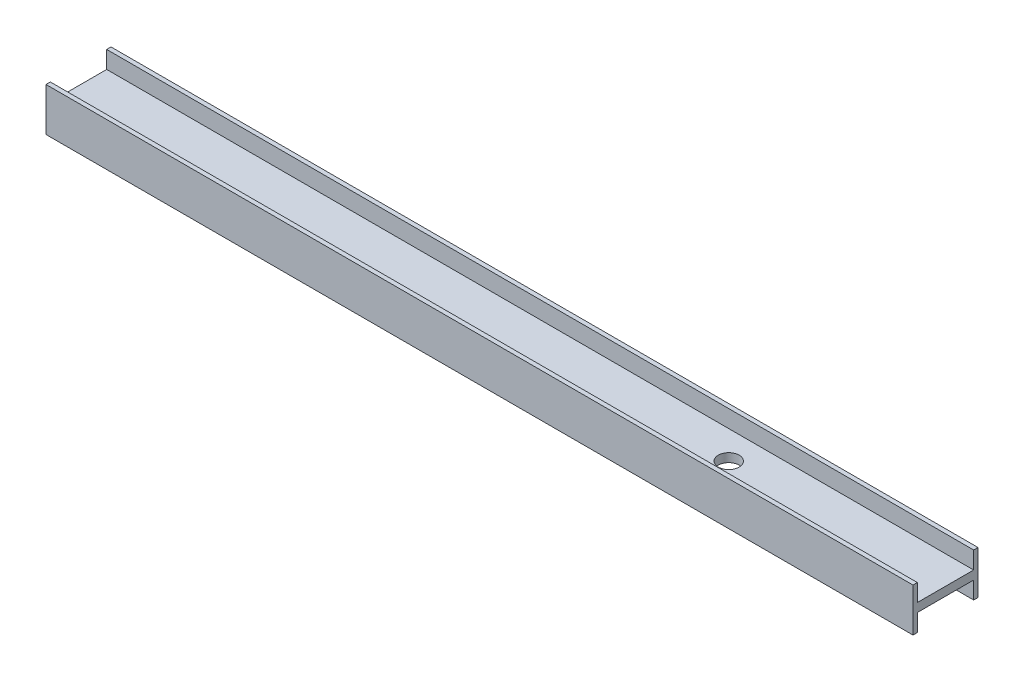
ISO-10303-21;
HEADER;
FILE_DESCRIPTION(('STEP AP214'),'2;1');
FILE_NAME('part.step','',(''),(''),'','','');
FILE_SCHEMA(('AUTOMOTIVE_DESIGN { 1 0 10303 214 1 1 1 1 }'));
ENDSEC;
DATA;
#1=APPLICATION_CONTEXT('core data for automotive mechanical design processes');
#2=APPLICATION_PROTOCOL_DEFINITION('international standard','automotive_design',2000,#1);
#3=PRODUCT_CONTEXT('',#1,'mechanical');
#4=PRODUCT('Part','Part','',(#3));
#5=PRODUCT_RELATED_PRODUCT_CATEGORY('part','',(#4));
#6=PRODUCT_DEFINITION_FORMATION('','',#4);
#7=PRODUCT_DEFINITION_CONTEXT('part definition',#1,'design');
#8=PRODUCT_DEFINITION('design','',#6,#7);
#9=PRODUCT_DEFINITION_SHAPE('','',#8);
#10=(LENGTH_UNIT() NAMED_UNIT(*) SI_UNIT(.MILLI.,.METRE.));
#11=(NAMED_UNIT(*) PLANE_ANGLE_UNIT() SI_UNIT($,.RADIAN.));
#12=(NAMED_UNIT(*) SI_UNIT($,.STERADIAN.) SOLID_ANGLE_UNIT());
#13=UNCERTAINTY_MEASURE_WITH_UNIT(LENGTH_MEASURE(1.E-05),#10,'distance_accuracy_value','');
#14=(GEOMETRIC_REPRESENTATION_CONTEXT(3) GLOBAL_UNCERTAINTY_ASSIGNED_CONTEXT((#13)) GLOBAL_UNIT_ASSIGNED_CONTEXT((#10,
#11,#12)) REPRESENTATION_CONTEXT('',''));
#15=CARTESIAN_POINT('',(0.,0.,0.));
#16=DIRECTION('',(0.,0.,1.));
#17=DIRECTION('',(1.,0.,0.));
#18=AXIS2_PLACEMENT_3D('',#15,#16,#17);
#19=CARTESIAN_POINT('',(0.,0.,0.));
#20=DIRECTION('',(0.,1.,0.));
#21=DIRECTION('',(0.,0.,1.));
#22=AXIS2_PLACEMENT_3D('',#19,#20,#21);
#23=PLANE('',#22);
#24=DIRECTION('',(0.,0.,1.));
#25=VECTOR('',#24,1.);
#26=CARTESIAN_POINT('',(-77.5368619947017,0.,2.4019268042116));
#27=LINE('',#26,#25);
#28=CARTESIAN_POINT('',(-77.5368619947017,0.,16.4019268042116));
#29=VERTEX_POINT('',#28);
#30=CARTESIAN_POINT('',(-77.5368619947017,0.,17.4019268042116));
#31=VERTEX_POINT('',#30);
#32=EDGE_CURVE('E168',#29,#31,#27,.T.);
#33=ORIENTED_EDGE('',*,*,#32,.F.);
#34=DIRECTION('',(-1.,0.,0.));
#35=VECTOR('',#34,1.);
#36=CARTESIAN_POINT('',(0.,0.,16.4019268042116));
#37=LINE('',#36,#35);
#38=CARTESIAN_POINT('',(122.463138005298,0.,16.4019268042116));
#39=VERTEX_POINT('',#38);
#40=EDGE_CURVE('E137',#39,#29,#37,.T.);
#41=ORIENTED_EDGE('',*,*,#40,.F.);
#42=DIRECTION('',(0.,0.,-1.));
#43=VECTOR('',#42,1.);
#44=CARTESIAN_POINT('',(122.463138005298,0.,2.4019268042116));
#45=LINE('',#44,#43);
#46=CARTESIAN_POINT('',(122.463138005298,0.,17.4019268042116));
#47=VERTEX_POINT('',#46);
#48=EDGE_CURVE('E192',#47,#39,#45,.T.);
#49=ORIENTED_EDGE('',*,*,#48,.F.);
#50=DIRECTION('',(1.,0.,0.));
#51=VECTOR('',#50,1.);
#52=CARTESIAN_POINT('',(-77.5368619947017,0.,17.4019268042116));
#53=LINE('',#52,#51);
#54=EDGE_CURVE('E189',#31,#47,#53,.T.);
#55=ORIENTED_EDGE('',*,*,#54,.F.);
#56=EDGE_LOOP('',(#33,#41,#49,#55));
#57=FACE_BOUND('',#56,.T.);
#58=ADVANCED_FACE('F33',(#57),#23,.F.);
#59=CARTESIAN_POINT('',(0.,10.,0.));
#60=DIRECTION('',(0.,1.,0.));
#61=DIRECTION('',(0.,0.,1.));
#62=AXIS2_PLACEMENT_3D('',#59,#60,#61);
#63=PLANE('',#62);
#64=DIRECTION('',(1.,0.,0.));
#65=VECTOR('',#64,1.);
#66=CARTESIAN_POINT('',(0.,10.,16.4019268042116));
#67=LINE('',#66,#65);
#68=CARTESIAN_POINT('',(-77.5368619947017,10.,16.4019268042116));
#69=VERTEX_POINT('',#68);
#70=CARTESIAN_POINT('',(122.463138005298,10.,16.4019268042116));
#71=VERTEX_POINT('',#70);
#72=EDGE_CURVE('E153',#69,#71,#67,.T.);
#73=ORIENTED_EDGE('',*,*,#72,.F.);
#74=DIRECTION('',(0.,0.,1.));
#75=VECTOR('',#74,1.);
#76=CARTESIAN_POINT('',(-77.5368619947017,10.,2.4019268042116));
#77=LINE('',#76,#75);
#78=CARTESIAN_POINT('',(-77.5368619947017,10.,17.4019268042116));
#79=VERTEX_POINT('',#78);
#80=EDGE_CURVE('E179',#69,#79,#77,.T.);
#81=ORIENTED_EDGE('',*,*,#80,.T.);
#82=DIRECTION('',(1.,0.,0.));
#83=VECTOR('',#82,1.);
#84=CARTESIAN_POINT('',(-77.5368619947017,10.,17.4019268042116));
#85=LINE('',#84,#83);
#86=CARTESIAN_POINT('',(122.463138005298,10.,17.4019268042116));
#87=VERTEX_POINT('',#86);
#88=EDGE_CURVE('E178',#79,#87,#85,.T.);
#89=ORIENTED_EDGE('',*,*,#88,.T.);
#90=DIRECTION('',(0.,0.,-1.));
#91=VECTOR('',#90,1.);
#92=CARTESIAN_POINT('',(122.463138005298,10.,2.4019268042116));
#93=LINE('',#92,#91);
#94=EDGE_CURVE('E182',#87,#71,#93,.T.);
#95=ORIENTED_EDGE('',*,*,#94,.T.);
#96=EDGE_LOOP('',(#73,#81,#89,#95));
#97=FACE_BOUND('',#96,.T.);
#98=ADVANCED_FACE('F244',(#97),#63,.T.);
#99=CARTESIAN_POINT('',(-77.5368619947017,10.,2.4019268042116));
#100=DIRECTION('',(1.,0.,0.));
#101=DIRECTION('',(0.,0.,-1.));
#102=AXIS2_PLACEMENT_3D('',#99,#100,#101);
#103=PLANE('',#102);
#104=DIRECTION('',(0.,0.,-1.));
#105=VECTOR('',#104,1.);
#106=CARTESIAN_POINT('',(-77.5368619947017,4.,0.));
#107=LINE('',#106,#105);
#108=CARTESIAN_POINT('',(-77.5368619947017,4.,16.4019268042116));
#109=VERTEX_POINT('',#108);
#110=CARTESIAN_POINT('',(-77.5368619947017,4.,3.4019268042116));
#111=VERTEX_POINT('',#110);
#112=EDGE_CURVE('E128',#109,#111,#107,.T.);
#113=ORIENTED_EDGE('',*,*,#112,.F.);
#114=DIRECTION('',(0.,-1.,0.));
#115=VECTOR('',#114,1.);
#116=CARTESIAN_POINT('',(-77.5368619947017,4.,16.4019268042116));
#117=LINE('',#116,#115);
#118=EDGE_CURVE('E163',#109,#29,#117,.T.);
#119=ORIENTED_EDGE('',*,*,#118,.T.);
#120=ORIENTED_EDGE('',*,*,#32,.T.);
#121=DIRECTION('',(0.,-1.,0.));
#122=VECTOR('',#121,1.);
#123=CARTESIAN_POINT('',(-77.5368619947017,10.,17.4019268042116));
#124=LINE('',#123,#122);
#125=EDGE_CURVE('E11',#79,#31,#124,.T.);
#126=ORIENTED_EDGE('',*,*,#125,.F.);
#127=ORIENTED_EDGE('',*,*,#80,.F.);
#128=DIRECTION('',(0.,1.,0.));
#129=VECTOR('',#128,1.);
#130=CARTESIAN_POINT('',(-77.5368619947017,6.,16.4019268042116));
#131=LINE('',#130,#129);
#132=CARTESIAN_POINT('',(-77.5368619947017,6.,16.4019268042116));
#133=VERTEX_POINT('',#132);
#134=EDGE_CURVE('E169',#133,#69,#131,.T.);
#135=ORIENTED_EDGE('',*,*,#134,.F.);
#136=DIRECTION('',(0.,0.,1.));
#137=VECTOR('',#136,1.);
#138=CARTESIAN_POINT('',(-77.5368619947017,6.,0.));
#139=LINE('',#138,#137);
#140=CARTESIAN_POINT('',(-77.5368619947017,6.,3.4019268042116));
#141=VERTEX_POINT('',#140);
#142=EDGE_CURVE('E156',#141,#133,#139,.T.);
#143=ORIENTED_EDGE('',*,*,#142,.F.);
#144=DIRECTION('',(0.,1.,0.));
#145=VECTOR('',#144,1.);
#146=CARTESIAN_POINT('',(-77.5368619947017,6.,3.4019268042116));
#147=LINE('',#146,#145);
#148=CARTESIAN_POINT('',(-77.5368619947017,10.,3.4019268042116));
#149=VERTEX_POINT('',#148);
#150=EDGE_CURVE('E171',#141,#149,#147,.T.);
#151=ORIENTED_EDGE('',*,*,#150,.T.);
#152=CARTESIAN_POINT('',(-77.5368619947017,10.,2.4019268042116));
#153=VERTEX_POINT('',#152);
#154=EDGE_CURVE('E175',#153,#149,#77,.T.);
#155=ORIENTED_EDGE('',*,*,#154,.F.);
#156=DIRECTION('',(0.,-1.,0.));
#157=VECTOR('',#156,1.);
#158=CARTESIAN_POINT('',(-77.5368619947017,10.,2.4019268042116));
#159=LINE('',#158,#157);
#160=CARTESIAN_POINT('',(-77.5368619947017,0.,2.4019268042116));
#161=VERTEX_POINT('',#160);
#162=EDGE_CURVE('E187',#153,#161,#159,.T.);
#163=ORIENTED_EDGE('',*,*,#162,.T.);
#164=CARTESIAN_POINT('',(-77.5368619947017,0.,3.4019268042116));
#165=VERTEX_POINT('',#164);
#166=EDGE_CURVE('E142',#161,#165,#27,.T.);
#167=ORIENTED_EDGE('',*,*,#166,.T.);
#168=DIRECTION('',(0.,-1.,0.));
#169=VECTOR('',#168,1.);
#170=CARTESIAN_POINT('',(-77.5368619947017,4.,3.4019268042116));
#171=LINE('',#170,#169);
#172=EDGE_CURVE('E48',#111,#165,#171,.T.);
#173=ORIENTED_EDGE('',*,*,#172,.F.);
#174=EDGE_LOOP('',(#113,#119,#120,#126,#127,#135,#143,#151,#155,#163,#167,#173));
#175=FACE_BOUND('',#174,.T.);
#176=ADVANCED_FACE('F35',(#175),#103,.F.);
#177=CARTESIAN_POINT('',(-77.5368619947017,10.,17.4019268042116));
#178=DIRECTION('',(0.,0.,-1.));
#179=DIRECTION('',(-1.,0.,0.));
#180=AXIS2_PLACEMENT_3D('',#177,#178,#179);
#181=PLANE('',#180);
#182=ORIENTED_EDGE('',*,*,#54,.T.);
#183=DIRECTION('',(0.,-1.,0.));
#184=VECTOR('',#183,1.);
#185=CARTESIAN_POINT('',(122.463138005298,10.,17.4019268042116));
#186=LINE('',#185,#184);
#187=EDGE_CURVE('E41',#87,#47,#186,.T.);
#188=ORIENTED_EDGE('',*,*,#187,.F.);
#189=ORIENTED_EDGE('',*,*,#88,.F.);
#190=ORIENTED_EDGE('',*,*,#125,.T.);
#191=EDGE_LOOP('',(#182,#188,#189,#190));
#192=FACE_BOUND('',#191,.T.);
#193=ADVANCED_FACE('F282',(#192),#181,.F.);
#194=CARTESIAN_POINT('',(122.463138005298,10.,2.4019268042116));
#195=DIRECTION('',(-1.,0.,0.));
#196=DIRECTION('',(0.,0.,1.));
#197=AXIS2_PLACEMENT_3D('',#194,#195,#196);
#198=PLANE('',#197);
#199=ORIENTED_EDGE('',*,*,#48,.T.);
#200=DIRECTION('',(0.,-1.,0.));
#201=VECTOR('',#200,1.);
#202=CARTESIAN_POINT('',(122.463138005298,4.,16.4019268042116));
#203=LINE('',#202,#201);
#204=CARTESIAN_POINT('',(122.463138005298,4.,16.4019268042116));
#205=VERTEX_POINT('',#204);
#206=EDGE_CURVE('E144',#205,#39,#203,.T.);
#207=ORIENTED_EDGE('',*,*,#206,.F.);
#208=DIRECTION('',(0.,0.,1.));
#209=VECTOR('',#208,1.);
#210=CARTESIAN_POINT('',(122.463138005298,4.,0.));
#211=LINE('',#210,#209);
#212=CARTESIAN_POINT('',(122.463138005298,4.,3.4019268042116));
#213=VERTEX_POINT('',#212);
#214=EDGE_CURVE('E127',#213,#205,#211,.T.);
#215=ORIENTED_EDGE('',*,*,#214,.F.);
#216=DIRECTION('',(0.,-1.,0.));
#217=VECTOR('',#216,1.);
#218=CARTESIAN_POINT('',(122.463138005298,4.,3.4019268042116));
#219=LINE('',#218,#217);
#220=CARTESIAN_POINT('',(122.463138005298,0.,3.4019268042116));
#221=VERTEX_POINT('',#220);
#222=EDGE_CURVE('E124',#213,#221,#219,.T.);
#223=ORIENTED_EDGE('',*,*,#222,.T.);
#224=CARTESIAN_POINT('',(122.463138005298,0.,2.4019268042116));
#225=VERTEX_POINT('',#224);
#226=EDGE_CURVE('E191',#221,#225,#45,.T.);
#227=ORIENTED_EDGE('',*,*,#226,.T.);
#228=DIRECTION('',(0.,-1.,0.));
#229=VECTOR('',#228,1.);
#230=CARTESIAN_POINT('',(122.463138005298,10.,2.4019268042116));
#231=LINE('',#230,#229);
#232=CARTESIAN_POINT('',(122.463138005298,10.,2.4019268042116));
#233=VERTEX_POINT('',#232);
#234=EDGE_CURVE('E198',#233,#225,#231,.T.);
#235=ORIENTED_EDGE('',*,*,#234,.F.);
#236=CARTESIAN_POINT('',(122.463138005298,10.,3.4019268042116));
#237=VERTEX_POINT('',#236);
#238=EDGE_CURVE('E181',#237,#233,#93,.T.);
#239=ORIENTED_EDGE('',*,*,#238,.F.);
#240=DIRECTION('',(0.,1.,0.));
#241=VECTOR('',#240,1.);
#242=CARTESIAN_POINT('',(122.463138005298,6.,3.4019268042116));
#243=LINE('',#242,#241);
#244=CARTESIAN_POINT('',(122.463138005298,6.,3.4019268042116));
#245=VERTEX_POINT('',#244);
#246=EDGE_CURVE('E56',#245,#237,#243,.T.);
#247=ORIENTED_EDGE('',*,*,#246,.F.);
#248=DIRECTION('',(0.,0.,-1.));
#249=VECTOR('',#248,1.);
#250=CARTESIAN_POINT('',(122.463138005298,6.,0.));
#251=LINE('',#250,#249);
#252=CARTESIAN_POINT('',(122.463138005298,6.,16.4019268042116));
#253=VERTEX_POINT('',#252);
#254=EDGE_CURVE('E149',#253,#245,#251,.T.);
#255=ORIENTED_EDGE('',*,*,#254,.F.);
#256=DIRECTION('',(0.,1.,0.));
#257=VECTOR('',#256,1.);
#258=CARTESIAN_POINT('',(122.463138005298,6.,16.4019268042116));
#259=LINE('',#258,#257);
#260=EDGE_CURVE('E165',#253,#71,#259,.T.);
#261=ORIENTED_EDGE('',*,*,#260,.T.);
#262=ORIENTED_EDGE('',*,*,#94,.F.);
#263=ORIENTED_EDGE('',*,*,#187,.T.);
#264=EDGE_LOOP('',(#199,#207,#215,#223,#227,#235,#239,#247,#255,#261,#262,#263));
#265=FACE_BOUND('',#264,.T.);
#266=ADVANCED_FACE('F205',(#265),#198,.F.);
#267=CARTESIAN_POINT('',(-77.5368619947017,10.,2.4019268042116));
#268=DIRECTION('',(0.,0.,1.));
#269=DIRECTION('',(1.,0.,0.));
#270=AXIS2_PLACEMENT_3D('',#267,#268,#269);
#271=PLANE('',#270);
#272=DIRECTION('',(-1.,0.,0.));
#273=VECTOR('',#272,1.);
#274=CARTESIAN_POINT('',(-77.5368619947017,0.,2.4019268042116));
#275=LINE('',#274,#273);
#276=EDGE_CURVE('E195',#225,#161,#275,.T.);
#277=ORIENTED_EDGE('',*,*,#276,.T.);
#278=ORIENTED_EDGE('',*,*,#162,.F.);
#279=DIRECTION('',(-1.,0.,0.));
#280=VECTOR('',#279,1.);
#281=CARTESIAN_POINT('',(-77.5368619947017,10.,2.4019268042116));
#282=LINE('',#281,#280);
#283=EDGE_CURVE('E185',#233,#153,#282,.T.);
#284=ORIENTED_EDGE('',*,*,#283,.F.);
#285=ORIENTED_EDGE('',*,*,#234,.T.);
#286=EDGE_LOOP('',(#277,#278,#284,#285));
#287=FACE_BOUND('',#286,.T.);
#288=ADVANCED_FACE('F264',(#287),#271,.F.);
#289=DIRECTION('',(-1.,0.,0.));
#290=VECTOR('',#289,1.);
#291=CARTESIAN_POINT('',(0.,10.,3.4019268042116));
#292=LINE('',#291,#290);
#293=EDGE_CURVE('E161',#237,#149,#292,.T.);
#294=ORIENTED_EDGE('',*,*,#293,.F.);
#295=ORIENTED_EDGE('',*,*,#238,.T.);
#296=ORIENTED_EDGE('',*,*,#283,.T.);
#297=ORIENTED_EDGE('',*,*,#154,.T.);
#298=EDGE_LOOP('',(#294,#295,#296,#297));
#299=FACE_BOUND('',#298,.T.);
#300=ADVANCED_FACE('F252',(#299),#63,.T.);
#301=ORIENTED_EDGE('',*,*,#226,.F.);
#302=DIRECTION('',(1.,0.,0.));
#303=VECTOR('',#302,1.);
#304=CARTESIAN_POINT('',(0.,0.,3.4019268042116));
#305=LINE('',#304,#303);
#306=EDGE_CURVE('E214',#165,#221,#305,.T.);
#307=ORIENTED_EDGE('',*,*,#306,.F.);
#308=ORIENTED_EDGE('',*,*,#166,.F.);
#309=ORIENTED_EDGE('',*,*,#276,.F.);
#310=EDGE_LOOP('',(#301,#307,#308,#309));
#311=FACE_BOUND('',#310,.T.);
#312=ADVANCED_FACE('F246',(#311),#23,.F.);
#313=CARTESIAN_POINT('',(0.,6.,16.4019268042116));
#314=DIRECTION('',(0.,0.,1.));
#315=DIRECTION('',(1.,0.,0.));
#316=AXIS2_PLACEMENT_3D('',#313,#314,#315);
#317=PLANE('',#316);
#318=ORIENTED_EDGE('',*,*,#72,.T.);
#319=ORIENTED_EDGE('',*,*,#260,.F.);
#320=DIRECTION('',(1.,0.,0.));
#321=VECTOR('',#320,1.);
#322=CARTESIAN_POINT('',(0.,6.,16.4019268042116));
#323=LINE('',#322,#321);
#324=EDGE_CURVE('E158',#133,#253,#323,.T.);
#325=ORIENTED_EDGE('',*,*,#324,.F.);
#326=ORIENTED_EDGE('',*,*,#134,.T.);
#327=EDGE_LOOP('',(#318,#319,#325,#326));
#328=FACE_BOUND('',#327,.T.);
#329=ADVANCED_FACE('F255',(#328),#317,.F.);
#330=CARTESIAN_POINT('',(0.,6.,3.4019268042116));
#331=DIRECTION('',(0.,0.,-1.));
#332=DIRECTION('',(-1.,0.,0.));
#333=AXIS2_PLACEMENT_3D('',#330,#331,#332);
#334=PLANE('',#333);
#335=ORIENTED_EDGE('',*,*,#293,.T.);
#336=ORIENTED_EDGE('',*,*,#150,.F.);
#337=DIRECTION('',(-1.,0.,0.));
#338=VECTOR('',#337,1.);
#339=CARTESIAN_POINT('',(0.,6.,3.4019268042116));
#340=LINE('',#339,#338);
#341=EDGE_CURVE('E152',#245,#141,#340,.T.);
#342=ORIENTED_EDGE('',*,*,#341,.F.);
#343=ORIENTED_EDGE('',*,*,#246,.T.);
#344=EDGE_LOOP('',(#335,#336,#342,#343));
#345=FACE_BOUND('',#344,.T.);
#346=ADVANCED_FACE('F261',(#345),#334,.F.);
#347=CARTESIAN_POINT('',(0.,6.,0.));
#348=DIRECTION('',(0.,1.,0.));
#349=DIRECTION('',(0.,0.,1.));
#350=AXIS2_PLACEMENT_3D('',#347,#348,#349);
#351=PLANE('',#350);
#352=CARTESIAN_POINT('',(72.4631380052983,6.,9.9019268042116));
#353=DIRECTION('',(0.,1.,0.));
#354=DIRECTION('',(0.,0.,1.));
#355=AXIS2_PLACEMENT_3D('',#352,#353,#354);
#356=CIRCLE('',#355,2.4);
#357=CARTESIAN_POINT('',(72.4631380052983,6.,12.3019268042116));
#358=VERTEX_POINT('',#357);
#359=EDGE_CURVE('E216',#358,#358,#356,.T.);
#360=ORIENTED_EDGE('',*,*,#359,.F.);
#361=EDGE_LOOP('',(#360));
#362=FACE_BOUND('',#361,.T.);
#363=ORIENTED_EDGE('',*,*,#254,.T.);
#364=ORIENTED_EDGE('',*,*,#341,.T.);
#365=ORIENTED_EDGE('',*,*,#142,.T.);
#366=ORIENTED_EDGE('',*,*,#324,.T.);
#367=EDGE_LOOP('',(#363,#364,#365,#366));
#368=FACE_BOUND('',#367,.T.);
#369=ADVANCED_FACE('F275',(#362,#368),#351,.T.);
#370=CARTESIAN_POINT('',(0.,4.,16.4019268042116));
#371=DIRECTION('',(0.,0.,1.));
#372=DIRECTION('',(1.,0.,0.));
#373=AXIS2_PLACEMENT_3D('',#370,#371,#372);
#374=PLANE('',#373);
#375=ORIENTED_EDGE('',*,*,#40,.T.);
#376=ORIENTED_EDGE('',*,*,#118,.F.);
#377=DIRECTION('',(-1.,0.,0.));
#378=VECTOR('',#377,1.);
#379=CARTESIAN_POINT('',(0.,4.,16.4019268042116));
#380=LINE('',#379,#378);
#381=EDGE_CURVE('E134',#205,#109,#380,.T.);
#382=ORIENTED_EDGE('',*,*,#381,.F.);
#383=ORIENTED_EDGE('',*,*,#206,.T.);
#384=EDGE_LOOP('',(#375,#376,#382,#383));
#385=FACE_BOUND('',#384,.T.);
#386=ADVANCED_FACE('F219',(#385),#374,.F.);
#387=CARTESIAN_POINT('',(0.,4.,3.4019268042116));
#388=DIRECTION('',(0.,0.,-1.));
#389=DIRECTION('',(-1.,0.,0.));
#390=AXIS2_PLACEMENT_3D('',#387,#388,#389);
#391=PLANE('',#390);
#392=ORIENTED_EDGE('',*,*,#306,.T.);
#393=ORIENTED_EDGE('',*,*,#222,.F.);
#394=DIRECTION('',(1.,0.,0.));
#395=VECTOR('',#394,1.);
#396=CARTESIAN_POINT('',(0.,4.,3.4019268042116));
#397=LINE('',#396,#395);
#398=EDGE_CURVE('E120',#111,#213,#397,.T.);
#399=ORIENTED_EDGE('',*,*,#398,.F.);
#400=ORIENTED_EDGE('',*,*,#172,.T.);
#401=EDGE_LOOP('',(#392,#393,#399,#400));
#402=FACE_BOUND('',#401,.T.);
#403=ADVANCED_FACE('F122',(#402),#391,.F.);
#404=CARTESIAN_POINT('',(0.,4.,0.));
#405=DIRECTION('',(0.,-1.,0.));
#406=DIRECTION('',(0.,0.,-1.));
#407=AXIS2_PLACEMENT_3D('',#404,#405,#406);
#408=PLANE('',#407);
#409=CARTESIAN_POINT('',(72.4631380052983,4.,9.9019268042116));
#410=DIRECTION('',(0.,-1.,0.));
#411=DIRECTION('',(0.,0.,-1.));
#412=AXIS2_PLACEMENT_3D('',#409,#410,#411);
#413=CIRCLE('',#412,2.4);
#414=CARTESIAN_POINT('',(72.4631380052983,4.,7.5019268042116));
#415=VERTEX_POINT('',#414);
#416=EDGE_CURVE('E225',#415,#415,#413,.T.);
#417=ORIENTED_EDGE('',*,*,#416,.F.);
#418=EDGE_LOOP('',(#417));
#419=FACE_BOUND('',#418,.T.);
#420=ORIENTED_EDGE('',*,*,#112,.T.);
#421=ORIENTED_EDGE('',*,*,#398,.T.);
#422=ORIENTED_EDGE('',*,*,#214,.T.);
#423=ORIENTED_EDGE('',*,*,#381,.T.);
#424=EDGE_LOOP('',(#420,#421,#422,#423));
#425=FACE_BOUND('',#424,.T.);
#426=ADVANCED_FACE('F132',(#419,#425),#408,.T.);
#427=CARTESIAN_POINT('',(72.4631380052983,14.,9.9019268042116));
#428=DIRECTION('',(0.,-1.,0.));
#429=DIRECTION('',(0.,0.,-1.));
#430=AXIS2_PLACEMENT_3D('',#427,#428,#429);
#431=CYLINDRICAL_SURFACE('',#430,2.4);
#432=ORIENTED_EDGE('',*,*,#359,.T.);
#433=EDGE_LOOP('',(#432));
#434=FACE_BOUND('',#433,.T.);
#435=ORIENTED_EDGE('',*,*,#416,.T.);
#436=EDGE_LOOP('',(#435));
#437=FACE_BOUND('',#436,.T.);
#438=ADVANCED_FACE('F229',(#434,#437),#431,.F.);
#439=CLOSED_SHELL('',(#58,#98,#176,#193,#266,#288,#300,#312,#329,#346,#369,#386,#403,#426,#438));
#440=MANIFOLD_SOLID_BREP('B2',#439);
#441=ADVANCED_BREP_SHAPE_REPRESENTATION('',(#18,#440),#14);
#442=SHAPE_DEFINITION_REPRESENTATION(#9,#441);
ENDSEC;
END-ISO-10303-21;
